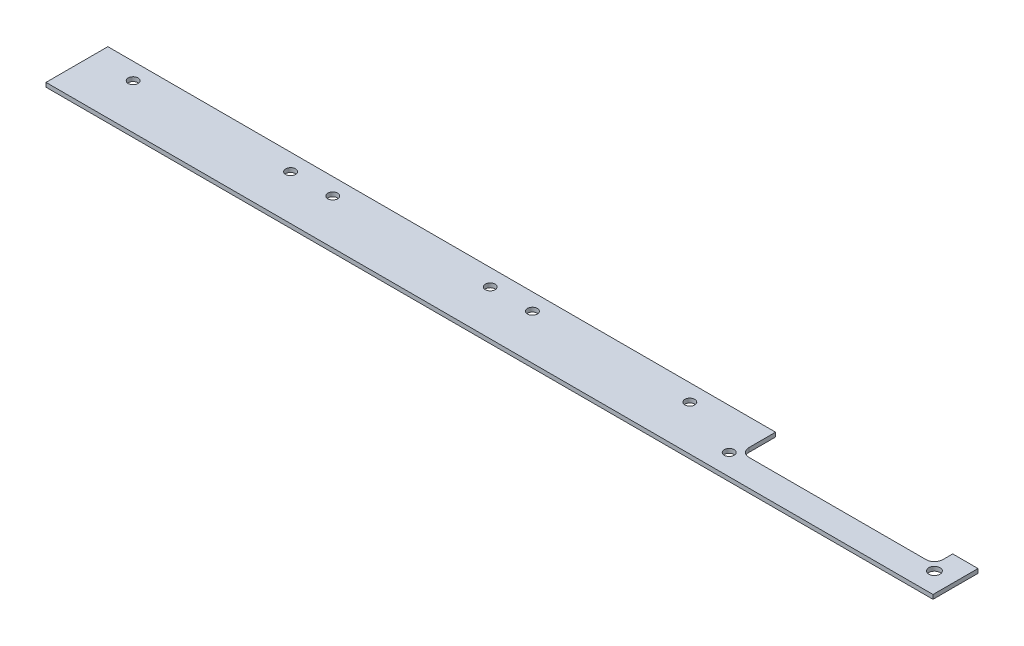
ISO-10303-21;
HEADER;
FILE_DESCRIPTION(('STEP AP214'),'2;1');
FILE_NAME('part.step','',(''),(''),'','','');
FILE_SCHEMA(('AUTOMOTIVE_DESIGN { 1 0 10303 214 1 1 1 1 }'));
ENDSEC;
DATA;
#1=APPLICATION_CONTEXT('core data for automotive mechanical design processes');
#2=APPLICATION_PROTOCOL_DEFINITION('international standard','automotive_design',2000,#1);
#3=PRODUCT_CONTEXT('',#1,'mechanical');
#4=PRODUCT('Part','Part','',(#3));
#5=PRODUCT_RELATED_PRODUCT_CATEGORY('part','',(#4));
#6=PRODUCT_DEFINITION_FORMATION('','',#4);
#7=PRODUCT_DEFINITION_CONTEXT('part definition',#1,'design');
#8=PRODUCT_DEFINITION('design','',#6,#7);
#9=PRODUCT_DEFINITION_SHAPE('','',#8);
#10=(LENGTH_UNIT() NAMED_UNIT(*) SI_UNIT(.MILLI.,.METRE.));
#11=(NAMED_UNIT(*) PLANE_ANGLE_UNIT() SI_UNIT($,.RADIAN.));
#12=(NAMED_UNIT(*) SI_UNIT($,.STERADIAN.) SOLID_ANGLE_UNIT());
#13=UNCERTAINTY_MEASURE_WITH_UNIT(LENGTH_MEASURE(1.E-05),#10,'distance_accuracy_value','');
#14=(GEOMETRIC_REPRESENTATION_CONTEXT(3) GLOBAL_UNCERTAINTY_ASSIGNED_CONTEXT((#13)) GLOBAL_UNIT_ASSIGNED_CONTEXT((#10,
#11,#12)) REPRESENTATION_CONTEXT('',''));
#15=CARTESIAN_POINT('',(0.,0.,0.));
#16=DIRECTION('',(0.,0.,1.));
#17=DIRECTION('',(1.,0.,0.));
#18=AXIS2_PLACEMENT_3D('',#15,#16,#17);
#19=CARTESIAN_POINT('',(240.5,1.5,-12.5));
#20=DIRECTION('',(0.,1.,0.));
#21=DIRECTION('',(0.,0.,1.));
#22=AXIS2_PLACEMENT_3D('',#19,#20,#21);
#23=PLANE('',#22);
#24=CARTESIAN_POINT('',(157.,1.5,-16.));
#25=DIRECTION('',(0.,1.,0.));
#26=DIRECTION('',(0.,0.,1.));
#27=AXIS2_PLACEMENT_3D('',#24,#25,#26);
#28=CIRCLE('',#27,1.74999999999998);
#29=CARTESIAN_POINT('',(157.,1.5,-14.25));
#30=VERTEX_POINT('',#29);
#31=EDGE_CURVE('E244',#30,#30,#28,.T.);
#32=ORIENTED_EDGE('',*,*,#31,.F.);
#33=EDGE_LOOP('',(#32));
#34=FACE_BOUND('',#33,.T.);
#35=CARTESIAN_POINT('',(142.,1.5,-16.));
#36=DIRECTION('',(0.,1.,0.));
#37=DIRECTION('',(0.,0.,1.));
#38=AXIS2_PLACEMENT_3D('',#35,#36,#37);
#39=CIRCLE('',#38,1.74999999999998);
#40=CARTESIAN_POINT('',(142.,1.5,-14.25));
#41=VERTEX_POINT('',#40);
#42=EDGE_CURVE('E232',#41,#41,#39,.T.);
#43=ORIENTED_EDGE('',*,*,#42,.F.);
#44=EDGE_LOOP('',(#43));
#45=FACE_BOUND('',#44,.T.);
#46=CARTESIAN_POINT('',(235.5,1.5,-7.5));
#47=DIRECTION('',(0.,1.,0.));
#48=DIRECTION('',(0.,0.,1.));
#49=AXIS2_PLACEMENT_3D('',#46,#47,#48);
#50=CIRCLE('',#49,1.75000000000001);
#51=CARTESIAN_POINT('',(235.5,1.5,-5.74999999999999));
#52=VERTEX_POINT('',#51);
#53=EDGE_CURVE('E220',#52,#52,#50,.T.);
#54=ORIENTED_EDGE('',*,*,#53,.F.);
#55=EDGE_LOOP('',(#54));
#56=FACE_BOUND('',#55,.T.);
#57=CARTESIAN_POINT('',(15.,1.5,-16.));
#58=DIRECTION('',(0.,1.,0.));
#59=DIRECTION('',(0.,0.,1.));
#60=AXIS2_PLACEMENT_3D('',#57,#58,#59);
#61=CIRCLE('',#60,1.75);
#62=CARTESIAN_POINT('',(15.,1.5,-14.25));
#63=VERTEX_POINT('',#62);
#64=EDGE_CURVE('E148',#63,#63,#61,.T.);
#65=ORIENTED_EDGE('',*,*,#64,.F.);
#66=EDGE_LOOP('',(#65));
#67=FACE_BOUND('',#66,.T.);
#68=DIRECTION('',(0.,0.,1.));
#69=VECTOR('',#68,1.);
#70=CARTESIAN_POINT('',(0.,1.5,0.));
#71=LINE('',#70,#69);
#72=CARTESIAN_POINT('',(0.,1.5,-22.));
#73=VERTEX_POINT('',#72);
#74=CARTESIAN_POINT('',(0.,1.5,0.));
#75=VERTEX_POINT('',#74);
#76=EDGE_CURVE('E163',#73,#75,#71,.T.);
#77=ORIENTED_EDGE('',*,*,#76,.T.);
#78=DIRECTION('',(1.,0.,0.));
#79=VECTOR('',#78,1.);
#80=CARTESIAN_POINT('',(0.,1.5,0.));
#81=LINE('',#80,#79);
#82=CARTESIAN_POINT('',(315.5,1.5,0.));
#83=VERTEX_POINT('',#82);
#84=EDGE_CURVE('E101',#75,#83,#81,.T.);
#85=ORIENTED_EDGE('',*,*,#84,.T.);
#86=DIRECTION('',(0.,0.,-1.));
#87=VECTOR('',#86,1.);
#88=CARTESIAN_POINT('',(315.5,1.5,-16.));
#89=LINE('',#88,#87);
#90=CARTESIAN_POINT('',(315.5,1.5,-16.));
#91=VERTEX_POINT('',#90);
#92=EDGE_CURVE('E184',#83,#91,#89,.T.);
#93=ORIENTED_EDGE('',*,*,#92,.T.);
#94=DIRECTION('',(-1.,0.,0.));
#95=VECTOR('',#94,1.);
#96=CARTESIAN_POINT('',(306.5,1.5,-16.));
#97=LINE('',#96,#95);
#98=CARTESIAN_POINT('',(306.5,1.5,-16.));
#99=VERTEX_POINT('',#98);
#100=EDGE_CURVE('E203',#91,#99,#97,.T.);
#101=ORIENTED_EDGE('',*,*,#100,.T.);
#102=DIRECTION('',(0.,0.,1.));
#103=VECTOR('',#102,1.);
#104=CARTESIAN_POINT('',(306.5,1.5,-12.5));
#105=LINE('',#104,#103);
#106=CARTESIAN_POINT('',(306.5,1.5,-12.5));
#107=VERTEX_POINT('',#106);
#108=EDGE_CURVE('E200',#99,#107,#105,.T.);
#109=ORIENTED_EDGE('',*,*,#108,.T.);
#110=CARTESIAN_POINT('',(303.5,1.5,-12.5));
#111=DIRECTION('',(0.,-1.,0.));
#112=DIRECTION('',(0.,0.,1.));
#113=AXIS2_PLACEMENT_3D('',#110,#111,#112);
#114=CIRCLE('',#113,3.);
#115=CARTESIAN_POINT('',(303.5,1.5,-9.5));
#116=VERTEX_POINT('',#115);
#117=EDGE_CURVE('E202',#107,#116,#114,.T.);
#118=ORIENTED_EDGE('',*,*,#117,.T.);
#119=DIRECTION('',(-1.,0.,0.));
#120=VECTOR('',#119,1.);
#121=CARTESIAN_POINT('',(240.5,1.5,-9.5));
#122=LINE('',#121,#120);
#123=CARTESIAN_POINT('',(240.5,1.5,-9.5));
#124=VERTEX_POINT('',#123);
#125=EDGE_CURVE('E126',#116,#124,#122,.T.);
#126=ORIENTED_EDGE('',*,*,#125,.T.);
#127=CARTESIAN_POINT('',(240.5,1.5,-12.5));
#128=DIRECTION('',(0.,-1.,0.));
#129=DIRECTION('',(0.,0.,1.));
#130=AXIS2_PLACEMENT_3D('',#127,#128,#129);
#131=CIRCLE('',#130,3.);
#132=CARTESIAN_POINT('',(237.5,1.5,-12.5));
#133=VERTEX_POINT('',#132);
#134=EDGE_CURVE('E120',#124,#133,#131,.T.);
#135=ORIENTED_EDGE('',*,*,#134,.T.);
#136=DIRECTION('',(0.,0.,-1.));
#137=VECTOR('',#136,1.);
#138=CARTESIAN_POINT('',(237.5,1.5,-22.));
#139=LINE('',#138,#137);
#140=CARTESIAN_POINT('',(237.5,1.5,-22.));
#141=VERTEX_POINT('',#140);
#142=EDGE_CURVE('E124',#133,#141,#139,.T.);
#143=ORIENTED_EDGE('',*,*,#142,.T.);
#144=DIRECTION('',(-1.,0.,0.));
#145=VECTOR('',#144,1.);
#146=CARTESIAN_POINT('',(0.,1.5,-22.));
#147=LINE('',#146,#145);
#148=EDGE_CURVE('E52',#141,#73,#147,.T.);
#149=ORIENTED_EDGE('',*,*,#148,.T.);
#150=EDGE_LOOP('',(#77,#85,#93,#101,#109,#118,#126,#135,#143,#149));
#151=FACE_BOUND('',#150,.T.);
#152=CARTESIAN_POINT('',(71.,1.5,-16.));
#153=DIRECTION('',(0.,1.,0.));
#154=DIRECTION('',(0.,0.,1.));
#155=AXIS2_PLACEMENT_3D('',#152,#153,#154);
#156=CIRCLE('',#155,1.75);
#157=CARTESIAN_POINT('',(71.,1.5,-14.25));
#158=VERTEX_POINT('',#157);
#159=EDGE_CURVE('E214',#158,#158,#156,.T.);
#160=ORIENTED_EDGE('',*,*,#159,.F.);
#161=EDGE_LOOP('',(#160));
#162=FACE_BOUND('',#161,.T.);
#163=CARTESIAN_POINT('',(85.9999999999999,1.5,-16.));
#164=DIRECTION('',(0.,1.,0.));
#165=DIRECTION('',(0.,0.,1.));
#166=AXIS2_PLACEMENT_3D('',#163,#164,#165);
#167=CIRCLE('',#166,1.75);
#168=CARTESIAN_POINT('',(85.9999999999999,1.5,-14.25));
#169=VERTEX_POINT('',#168);
#170=EDGE_CURVE('E226',#169,#169,#167,.T.);
#171=ORIENTED_EDGE('',*,*,#170,.F.);
#172=EDGE_LOOP('',(#171));
#173=FACE_BOUND('',#172,.T.);
#174=CARTESIAN_POINT('',(308.5,1.5,-7.5));
#175=DIRECTION('',(0.,1.,0.));
#176=DIRECTION('',(0.,0.,1.));
#177=AXIS2_PLACEMENT_3D('',#174,#175,#176);
#178=CIRCLE('',#177,2.);
#179=CARTESIAN_POINT('',(308.5,1.5,-5.5));
#180=VERTEX_POINT('',#179);
#181=EDGE_CURVE('E238',#180,#180,#178,.T.);
#182=ORIENTED_EDGE('',*,*,#181,.F.);
#183=EDGE_LOOP('',(#182));
#184=FACE_BOUND('',#183,.T.);
#185=CARTESIAN_POINT('',(213.,1.5,-16.));
#186=DIRECTION('',(0.,1.,0.));
#187=DIRECTION('',(0.,0.,1.));
#188=AXIS2_PLACEMENT_3D('',#185,#186,#187);
#189=CIRCLE('',#188,1.75000000000001);
#190=CARTESIAN_POINT('',(213.,1.5,-14.25));
#191=VERTEX_POINT('',#190);
#192=EDGE_CURVE('E250',#191,#191,#189,.T.);
#193=ORIENTED_EDGE('',*,*,#192,.F.);
#194=EDGE_LOOP('',(#193));
#195=FACE_BOUND('',#194,.T.);
#196=ADVANCED_FACE('F35',(#34,#45,#56,#67,#151,#162,#173,#184,#195),#23,.T.);
#197=CARTESIAN_POINT('',(240.5,0.,-12.5));
#198=DIRECTION('',(0.,1.,0.));
#199=DIRECTION('',(0.,0.,1.));
#200=AXIS2_PLACEMENT_3D('',#197,#198,#199);
#201=PLANE('',#200);
#202=DIRECTION('',(0.,0.,1.));
#203=VECTOR('',#202,1.);
#204=CARTESIAN_POINT('',(0.,0.,0.));
#205=LINE('',#204,#203);
#206=CARTESIAN_POINT('',(0.,0.,-22.));
#207=VERTEX_POINT('',#206);
#208=CARTESIAN_POINT('',(0.,0.,0.));
#209=VERTEX_POINT('',#208);
#210=EDGE_CURVE('E144',#207,#209,#205,.T.);
#211=ORIENTED_EDGE('',*,*,#210,.F.);
#212=DIRECTION('',(-1.,0.,0.));
#213=VECTOR('',#212,1.);
#214=CARTESIAN_POINT('',(0.,0.,-22.));
#215=LINE('',#214,#213);
#216=CARTESIAN_POINT('',(237.5,0.,-22.));
#217=VERTEX_POINT('',#216);
#218=EDGE_CURVE('E93',#217,#207,#215,.T.);
#219=ORIENTED_EDGE('',*,*,#218,.F.);
#220=DIRECTION('',(0.,0.,-1.));
#221=VECTOR('',#220,1.);
#222=CARTESIAN_POINT('',(237.5,0.,-22.));
#223=LINE('',#222,#221);
#224=CARTESIAN_POINT('',(237.5,0.,-12.5));
#225=VERTEX_POINT('',#224);
#226=EDGE_CURVE('E87',#225,#217,#223,.T.);
#227=ORIENTED_EDGE('',*,*,#226,.F.);
#228=CARTESIAN_POINT('',(240.5,0.,-12.5));
#229=DIRECTION('',(0.,-1.,0.));
#230=DIRECTION('',(0.,0.,1.));
#231=AXIS2_PLACEMENT_3D('',#228,#229,#230);
#232=CIRCLE('',#231,3.);
#233=CARTESIAN_POINT('',(240.5,0.,-9.5));
#234=VERTEX_POINT('',#233);
#235=EDGE_CURVE('E134',#234,#225,#232,.T.);
#236=ORIENTED_EDGE('',*,*,#235,.F.);
#237=DIRECTION('',(-1.,0.,0.));
#238=VECTOR('',#237,1.);
#239=CARTESIAN_POINT('',(240.5,0.,-9.5));
#240=LINE('',#239,#238);
#241=CARTESIAN_POINT('',(303.5,0.,-9.5));
#242=VERTEX_POINT('',#241);
#243=EDGE_CURVE('E158',#242,#234,#240,.T.);
#244=ORIENTED_EDGE('',*,*,#243,.F.);
#245=CARTESIAN_POINT('',(303.5,0.,-12.5));
#246=DIRECTION('',(0.,-1.,0.));
#247=DIRECTION('',(0.,0.,1.));
#248=AXIS2_PLACEMENT_3D('',#245,#246,#247);
#249=CIRCLE('',#248,3.);
#250=CARTESIAN_POINT('',(306.5,0.,-12.5));
#251=VERTEX_POINT('',#250);
#252=EDGE_CURVE('E156',#251,#242,#249,.T.);
#253=ORIENTED_EDGE('',*,*,#252,.F.);
#254=DIRECTION('',(0.,0.,1.));
#255=VECTOR('',#254,1.);
#256=CARTESIAN_POINT('',(306.5,0.,-12.5));
#257=LINE('',#256,#255);
#258=CARTESIAN_POINT('',(306.5,0.,-16.));
#259=VERTEX_POINT('',#258);
#260=EDGE_CURVE('E154',#259,#251,#257,.T.);
#261=ORIENTED_EDGE('',*,*,#260,.F.);
#262=DIRECTION('',(-1.,0.,0.));
#263=VECTOR('',#262,1.);
#264=CARTESIAN_POINT('',(306.5,0.,-16.));
#265=LINE('',#264,#263);
#266=CARTESIAN_POINT('',(315.5,0.,-16.));
#267=VERTEX_POINT('',#266);
#268=EDGE_CURVE('E152',#267,#259,#265,.T.);
#269=ORIENTED_EDGE('',*,*,#268,.F.);
#270=DIRECTION('',(0.,0.,-1.));
#271=VECTOR('',#270,1.);
#272=CARTESIAN_POINT('',(315.5,0.,-16.));
#273=LINE('',#272,#271);
#274=CARTESIAN_POINT('',(315.5,0.,0.));
#275=VERTEX_POINT('',#274);
#276=EDGE_CURVE('E150',#275,#267,#273,.T.);
#277=ORIENTED_EDGE('',*,*,#276,.F.);
#278=DIRECTION('',(1.,0.,0.));
#279=VECTOR('',#278,1.);
#280=CARTESIAN_POINT('',(0.,0.,0.));
#281=LINE('',#280,#279);
#282=EDGE_CURVE('E147',#209,#275,#281,.T.);
#283=ORIENTED_EDGE('',*,*,#282,.F.);
#284=EDGE_LOOP('',(#211,#219,#227,#236,#244,#253,#261,#269,#277,#283));
#285=FACE_BOUND('',#284,.T.);
#286=CARTESIAN_POINT('',(15.,0.,-16.));
#287=DIRECTION('',(0.,1.,0.));
#288=DIRECTION('',(0.,0.,1.));
#289=AXIS2_PLACEMENT_3D('',#286,#287,#288);
#290=CIRCLE('',#289,1.75);
#291=CARTESIAN_POINT('',(15.,0.,-14.25));
#292=VERTEX_POINT('',#291);
#293=EDGE_CURVE('E211',#292,#292,#290,.T.);
#294=ORIENTED_EDGE('',*,*,#293,.T.);
#295=EDGE_LOOP('',(#294));
#296=FACE_BOUND('',#295,.T.);
#297=CARTESIAN_POINT('',(71.,0.,-16.));
#298=DIRECTION('',(0.,1.,0.));
#299=DIRECTION('',(0.,0.,1.));
#300=AXIS2_PLACEMENT_3D('',#297,#298,#299);
#301=CIRCLE('',#300,1.75);
#302=CARTESIAN_POINT('',(71.,0.,-14.25));
#303=VERTEX_POINT('',#302);
#304=EDGE_CURVE('E217',#303,#303,#301,.T.);
#305=ORIENTED_EDGE('',*,*,#304,.T.);
#306=EDGE_LOOP('',(#305));
#307=FACE_BOUND('',#306,.T.);
#308=CARTESIAN_POINT('',(235.5,0.,-7.5));
#309=DIRECTION('',(0.,1.,0.));
#310=DIRECTION('',(0.,0.,1.));
#311=AXIS2_PLACEMENT_3D('',#308,#309,#310);
#312=CIRCLE('',#311,1.75000000000001);
#313=CARTESIAN_POINT('',(235.5,0.,-5.74999999999999));
#314=VERTEX_POINT('',#313);
#315=EDGE_CURVE('E223',#314,#314,#312,.T.);
#316=ORIENTED_EDGE('',*,*,#315,.T.);
#317=EDGE_LOOP('',(#316));
#318=FACE_BOUND('',#317,.T.);
#319=CARTESIAN_POINT('',(85.9999999999999,0.,-16.));
#320=DIRECTION('',(0.,1.,0.));
#321=DIRECTION('',(0.,0.,1.));
#322=AXIS2_PLACEMENT_3D('',#319,#320,#321);
#323=CIRCLE('',#322,1.75);
#324=CARTESIAN_POINT('',(85.9999999999999,0.,-14.25));
#325=VERTEX_POINT('',#324);
#326=EDGE_CURVE('E229',#325,#325,#323,.T.);
#327=ORIENTED_EDGE('',*,*,#326,.T.);
#328=EDGE_LOOP('',(#327));
#329=FACE_BOUND('',#328,.T.);
#330=CARTESIAN_POINT('',(142.,0.,-16.));
#331=DIRECTION('',(0.,1.,0.));
#332=DIRECTION('',(0.,0.,1.));
#333=AXIS2_PLACEMENT_3D('',#330,#331,#332);
#334=CIRCLE('',#333,1.74999999999998);
#335=CARTESIAN_POINT('',(142.,0.,-14.25));
#336=VERTEX_POINT('',#335);
#337=EDGE_CURVE('E235',#336,#336,#334,.T.);
#338=ORIENTED_EDGE('',*,*,#337,.T.);
#339=EDGE_LOOP('',(#338));
#340=FACE_BOUND('',#339,.T.);
#341=CARTESIAN_POINT('',(308.5,0.,-7.5));
#342=DIRECTION('',(0.,1.,0.));
#343=DIRECTION('',(0.,0.,1.));
#344=AXIS2_PLACEMENT_3D('',#341,#342,#343);
#345=CIRCLE('',#344,2.);
#346=CARTESIAN_POINT('',(308.5,0.,-5.5));
#347=VERTEX_POINT('',#346);
#348=EDGE_CURVE('E241',#347,#347,#345,.T.);
#349=ORIENTED_EDGE('',*,*,#348,.T.);
#350=EDGE_LOOP('',(#349));
#351=FACE_BOUND('',#350,.T.);
#352=CARTESIAN_POINT('',(157.,0.,-16.));
#353=DIRECTION('',(0.,1.,0.));
#354=DIRECTION('',(0.,0.,1.));
#355=AXIS2_PLACEMENT_3D('',#352,#353,#354);
#356=CIRCLE('',#355,1.74999999999998);
#357=CARTESIAN_POINT('',(157.,0.,-14.25));
#358=VERTEX_POINT('',#357);
#359=EDGE_CURVE('E247',#358,#358,#356,.T.);
#360=ORIENTED_EDGE('',*,*,#359,.T.);
#361=EDGE_LOOP('',(#360));
#362=FACE_BOUND('',#361,.T.);
#363=CARTESIAN_POINT('',(213.,0.,-16.));
#364=DIRECTION('',(0.,1.,0.));
#365=DIRECTION('',(0.,0.,1.));
#366=AXIS2_PLACEMENT_3D('',#363,#364,#365);
#367=CIRCLE('',#366,1.75000000000001);
#368=CARTESIAN_POINT('',(213.,0.,-14.25));
#369=VERTEX_POINT('',#368);
#370=EDGE_CURVE('E253',#369,#369,#367,.T.);
#371=ORIENTED_EDGE('',*,*,#370,.T.);
#372=EDGE_LOOP('',(#371));
#373=FACE_BOUND('',#372,.T.);
#374=ADVANCED_FACE('F188',(#285,#296,#307,#318,#329,#340,#351,#362,#373),#201,.F.);
#375=CARTESIAN_POINT('',(0.,1.5,0.));
#376=DIRECTION('',(1.,0.,0.));
#377=DIRECTION('',(0.,0.,-1.));
#378=AXIS2_PLACEMENT_3D('',#375,#376,#377);
#379=PLANE('',#378);
#380=ORIENTED_EDGE('',*,*,#210,.T.);
#381=DIRECTION('',(0.,-1.,0.));
#382=VECTOR('',#381,1.);
#383=CARTESIAN_POINT('',(0.,1.5,0.));
#384=LINE('',#383,#382);
#385=EDGE_CURVE('E11',#75,#209,#384,.T.);
#386=ORIENTED_EDGE('',*,*,#385,.F.);
#387=ORIENTED_EDGE('',*,*,#76,.F.);
#388=DIRECTION('',(0.,-1.,0.));
#389=VECTOR('',#388,1.);
#390=CARTESIAN_POINT('',(0.,1.5,-22.));
#391=LINE('',#390,#389);
#392=EDGE_CURVE('E140',#73,#207,#391,.T.);
#393=ORIENTED_EDGE('',*,*,#392,.T.);
#394=EDGE_LOOP('',(#380,#386,#387,#393));
#395=FACE_BOUND('',#394,.T.);
#396=ADVANCED_FACE('F37',(#395),#379,.F.);
#397=CARTESIAN_POINT('',(0.,1.5,0.));
#398=DIRECTION('',(0.,0.,-1.));
#399=DIRECTION('',(-1.,0.,0.));
#400=AXIS2_PLACEMENT_3D('',#397,#398,#399);
#401=PLANE('',#400);
#402=ORIENTED_EDGE('',*,*,#282,.T.);
#403=DIRECTION('',(0.,-1.,0.));
#404=VECTOR('',#403,1.);
#405=CARTESIAN_POINT('',(315.5,1.5,0.));
#406=LINE('',#405,#404);
#407=EDGE_CURVE('E44',#83,#275,#406,.T.);
#408=ORIENTED_EDGE('',*,*,#407,.F.);
#409=ORIENTED_EDGE('',*,*,#84,.F.);
#410=ORIENTED_EDGE('',*,*,#385,.T.);
#411=EDGE_LOOP('',(#402,#408,#409,#410));
#412=FACE_BOUND('',#411,.T.);
#413=ADVANCED_FACE('F295',(#412),#401,.F.);
#414=CARTESIAN_POINT('',(315.5,1.5,-16.));
#415=DIRECTION('',(-1.,0.,0.));
#416=DIRECTION('',(0.,0.,1.));
#417=AXIS2_PLACEMENT_3D('',#414,#415,#416);
#418=PLANE('',#417);
#419=ORIENTED_EDGE('',*,*,#276,.T.);
#420=DIRECTION('',(0.,-1.,0.));
#421=VECTOR('',#420,1.);
#422=CARTESIAN_POINT('',(315.5,1.5,-16.));
#423=LINE('',#422,#421);
#424=EDGE_CURVE('E176',#91,#267,#423,.T.);
#425=ORIENTED_EDGE('',*,*,#424,.F.);
#426=ORIENTED_EDGE('',*,*,#92,.F.);
#427=ORIENTED_EDGE('',*,*,#407,.T.);
#428=EDGE_LOOP('',(#419,#425,#426,#427));
#429=FACE_BOUND('',#428,.T.);
#430=ADVANCED_FACE('F182',(#429),#418,.F.);
#431=CARTESIAN_POINT('',(306.5,1.5,-16.));
#432=DIRECTION('',(0.,0.,1.));
#433=DIRECTION('',(1.,0.,0.));
#434=AXIS2_PLACEMENT_3D('',#431,#432,#433);
#435=PLANE('',#434);
#436=ORIENTED_EDGE('',*,*,#268,.T.);
#437=DIRECTION('',(0.,-1.,0.));
#438=VECTOR('',#437,1.);
#439=CARTESIAN_POINT('',(306.5,1.5,-16.));
#440=LINE('',#439,#438);
#441=EDGE_CURVE('E173',#99,#259,#440,.T.);
#442=ORIENTED_EDGE('',*,*,#441,.F.);
#443=ORIENTED_EDGE('',*,*,#100,.F.);
#444=ORIENTED_EDGE('',*,*,#424,.T.);
#445=EDGE_LOOP('',(#436,#442,#443,#444));
#446=FACE_BOUND('',#445,.T.);
#447=ADVANCED_FACE('F194',(#446),#435,.F.);
#448=CARTESIAN_POINT('',(306.5,1.5,-12.5));
#449=DIRECTION('',(1.,0.,0.));
#450=DIRECTION('',(0.,0.,-1.));
#451=AXIS2_PLACEMENT_3D('',#448,#449,#450);
#452=PLANE('',#451);
#453=ORIENTED_EDGE('',*,*,#260,.T.);
#454=DIRECTION('',(0.,-1.,0.));
#455=VECTOR('',#454,1.);
#456=CARTESIAN_POINT('',(306.5,1.5,-12.5));
#457=LINE('',#456,#455);
#458=EDGE_CURVE('E170',#107,#251,#457,.T.);
#459=ORIENTED_EDGE('',*,*,#458,.F.);
#460=ORIENTED_EDGE('',*,*,#108,.F.);
#461=ORIENTED_EDGE('',*,*,#441,.T.);
#462=EDGE_LOOP('',(#453,#459,#460,#461));
#463=FACE_BOUND('',#462,.T.);
#464=ADVANCED_FACE('F198',(#463),#452,.F.);
#465=CARTESIAN_POINT('',(303.5,1.5,-12.5));
#466=DIRECTION('',(0.,-1.,0.));
#467=DIRECTION('',(0.,0.,-1.));
#468=AXIS2_PLACEMENT_3D('',#465,#466,#467);
#469=CYLINDRICAL_SURFACE('',#468,3.);
#470=ORIENTED_EDGE('',*,*,#252,.T.);
#471=DIRECTION('',(0.,-1.,0.));
#472=VECTOR('',#471,1.);
#473=CARTESIAN_POINT('',(303.5,1.5,-9.5));
#474=LINE('',#473,#472);
#475=EDGE_CURVE('E167',#116,#242,#474,.T.);
#476=ORIENTED_EDGE('',*,*,#475,.F.);
#477=ORIENTED_EDGE('',*,*,#117,.F.);
#478=ORIENTED_EDGE('',*,*,#458,.T.);
#479=EDGE_LOOP('',(#470,#476,#477,#478));
#480=FACE_BOUND('',#479,.T.);
#481=ADVANCED_FACE('F285',(#480),#469,.F.);
#482=CARTESIAN_POINT('',(240.5,1.5,-9.5));
#483=DIRECTION('',(0.,0.,1.));
#484=DIRECTION('',(1.,0.,0.));
#485=AXIS2_PLACEMENT_3D('',#482,#483,#484);
#486=PLANE('',#485);
#487=ORIENTED_EDGE('',*,*,#243,.T.);
#488=DIRECTION('',(0.,-1.,0.));
#489=VECTOR('',#488,1.);
#490=CARTESIAN_POINT('',(240.5,1.5,-9.5));
#491=LINE('',#490,#489);
#492=EDGE_CURVE('E135',#124,#234,#491,.T.);
#493=ORIENTED_EDGE('',*,*,#492,.F.);
#494=ORIENTED_EDGE('',*,*,#125,.F.);
#495=ORIENTED_EDGE('',*,*,#475,.T.);
#496=EDGE_LOOP('',(#487,#493,#494,#495));
#497=FACE_BOUND('',#496,.T.);
#498=ADVANCED_FACE('F282',(#497),#486,.F.);
#499=CARTESIAN_POINT('',(240.5,1.5,-12.5));
#500=DIRECTION('',(0.,-1.,0.));
#501=DIRECTION('',(0.,0.,-1.));
#502=AXIS2_PLACEMENT_3D('',#499,#500,#501);
#503=CYLINDRICAL_SURFACE('',#502,3.);
#504=ORIENTED_EDGE('',*,*,#235,.T.);
#505=DIRECTION('',(0.,-1.,0.));
#506=VECTOR('',#505,1.);
#507=CARTESIAN_POINT('',(237.5,1.5,-12.5));
#508=LINE('',#507,#506);
#509=EDGE_CURVE('E131',#133,#225,#508,.T.);
#510=ORIENTED_EDGE('',*,*,#509,.F.);
#511=ORIENTED_EDGE('',*,*,#134,.F.);
#512=ORIENTED_EDGE('',*,*,#492,.T.);
#513=EDGE_LOOP('',(#504,#510,#511,#512));
#514=FACE_BOUND('',#513,.T.);
#515=ADVANCED_FACE('F132',(#514),#503,.F.);
#516=CARTESIAN_POINT('',(237.5,1.5,-22.));
#517=DIRECTION('',(-1.,0.,0.));
#518=DIRECTION('',(0.,0.,1.));
#519=AXIS2_PLACEMENT_3D('',#516,#517,#518);
#520=PLANE('',#519);
#521=ORIENTED_EDGE('',*,*,#226,.T.);
#522=DIRECTION('',(0.,-1.,0.));
#523=VECTOR('',#522,1.);
#524=CARTESIAN_POINT('',(237.5,1.5,-22.));
#525=LINE('',#524,#523);
#526=EDGE_CURVE('E136',#141,#217,#525,.T.);
#527=ORIENTED_EDGE('',*,*,#526,.F.);
#528=ORIENTED_EDGE('',*,*,#142,.F.);
#529=ORIENTED_EDGE('',*,*,#509,.T.);
#530=EDGE_LOOP('',(#521,#527,#528,#529));
#531=FACE_BOUND('',#530,.T.);
#532=ADVANCED_FACE('F138',(#531),#520,.F.);
#533=CARTESIAN_POINT('',(0.,1.5,-22.));
#534=DIRECTION('',(0.,0.,1.));
#535=DIRECTION('',(1.,0.,0.));
#536=AXIS2_PLACEMENT_3D('',#533,#534,#535);
#537=PLANE('',#536);
#538=ORIENTED_EDGE('',*,*,#218,.T.);
#539=ORIENTED_EDGE('',*,*,#392,.F.);
#540=ORIENTED_EDGE('',*,*,#148,.F.);
#541=ORIENTED_EDGE('',*,*,#526,.T.);
#542=EDGE_LOOP('',(#538,#539,#540,#541));
#543=FACE_BOUND('',#542,.T.);
#544=ADVANCED_FACE('F275',(#543),#537,.F.);
#545=CARTESIAN_POINT('',(15.,1.5,-16.));
#546=DIRECTION('',(0.,-1.,0.));
#547=DIRECTION('',(0.,0.,-1.));
#548=AXIS2_PLACEMENT_3D('',#545,#546,#547);
#549=CYLINDRICAL_SURFACE('',#548,1.75);
#550=ORIENTED_EDGE('',*,*,#64,.T.);
#551=EDGE_LOOP('',(#550));
#552=FACE_BOUND('',#551,.T.);
#553=ORIENTED_EDGE('',*,*,#293,.F.);
#554=EDGE_LOOP('',(#553));
#555=FACE_BOUND('',#554,.T.);
#556=ADVANCED_FACE('F272',(#552,#555),#549,.F.);
#557=CARTESIAN_POINT('',(71.,1.5,-16.));
#558=DIRECTION('',(0.,-1.,0.));
#559=DIRECTION('',(0.,0.,-1.));
#560=AXIS2_PLACEMENT_3D('',#557,#558,#559);
#561=CYLINDRICAL_SURFACE('',#560,1.75);
#562=ORIENTED_EDGE('',*,*,#159,.T.);
#563=EDGE_LOOP('',(#562));
#564=FACE_BOUND('',#563,.T.);
#565=ORIENTED_EDGE('',*,*,#304,.F.);
#566=EDGE_LOOP('',(#565));
#567=FACE_BOUND('',#566,.T.);
#568=ADVANCED_FACE('F371',(#564,#567),#561,.F.);
#569=CARTESIAN_POINT('',(235.5,1.5,-7.5));
#570=DIRECTION('',(0.,-1.,0.));
#571=DIRECTION('',(0.,0.,-1.));
#572=AXIS2_PLACEMENT_3D('',#569,#570,#571);
#573=CYLINDRICAL_SURFACE('',#572,1.75000000000001);
#574=ORIENTED_EDGE('',*,*,#53,.T.);
#575=EDGE_LOOP('',(#574));
#576=FACE_BOUND('',#575,.T.);
#577=ORIENTED_EDGE('',*,*,#315,.F.);
#578=EDGE_LOOP('',(#577));
#579=FACE_BOUND('',#578,.T.);
#580=ADVANCED_FACE('F379',(#576,#579),#573,.F.);
#581=CARTESIAN_POINT('',(85.9999999999999,1.5,-16.));
#582=DIRECTION('',(0.,-1.,0.));
#583=DIRECTION('',(0.,0.,-1.));
#584=AXIS2_PLACEMENT_3D('',#581,#582,#583);
#585=CYLINDRICAL_SURFACE('',#584,1.75);
#586=ORIENTED_EDGE('',*,*,#170,.T.);
#587=EDGE_LOOP('',(#586));
#588=FACE_BOUND('',#587,.T.);
#589=ORIENTED_EDGE('',*,*,#326,.F.);
#590=EDGE_LOOP('',(#589));
#591=FACE_BOUND('',#590,.T.);
#592=ADVANCED_FACE('F387',(#588,#591),#585,.F.);
#593=CARTESIAN_POINT('',(142.,1.5,-16.));
#594=DIRECTION('',(0.,-1.,0.));
#595=DIRECTION('',(0.,0.,-1.));
#596=AXIS2_PLACEMENT_3D('',#593,#594,#595);
#597=CYLINDRICAL_SURFACE('',#596,1.74999999999998);
#598=ORIENTED_EDGE('',*,*,#42,.T.);
#599=EDGE_LOOP('',(#598));
#600=FACE_BOUND('',#599,.T.);
#601=ORIENTED_EDGE('',*,*,#337,.F.);
#602=EDGE_LOOP('',(#601));
#603=FACE_BOUND('',#602,.T.);
#604=ADVANCED_FACE('F396',(#600,#603),#597,.F.);
#605=CARTESIAN_POINT('',(308.5,1.5,-7.5));
#606=DIRECTION('',(0.,-1.,0.));
#607=DIRECTION('',(0.,0.,-1.));
#608=AXIS2_PLACEMENT_3D('',#605,#606,#607);
#609=CYLINDRICAL_SURFACE('',#608,2.);
#610=ORIENTED_EDGE('',*,*,#181,.T.);
#611=EDGE_LOOP('',(#610));
#612=FACE_BOUND('',#611,.T.);
#613=ORIENTED_EDGE('',*,*,#348,.F.);
#614=EDGE_LOOP('',(#613));
#615=FACE_BOUND('',#614,.T.);
#616=ADVANCED_FACE('F405',(#612,#615),#609,.F.);
#617=CARTESIAN_POINT('',(157.,1.5,-16.));
#618=DIRECTION('',(0.,-1.,0.));
#619=DIRECTION('',(0.,0.,-1.));
#620=AXIS2_PLACEMENT_3D('',#617,#618,#619);
#621=CYLINDRICAL_SURFACE('',#620,1.74999999999998);
#622=ORIENTED_EDGE('',*,*,#31,.T.);
#623=EDGE_LOOP('',(#622));
#624=FACE_BOUND('',#623,.T.);
#625=ORIENTED_EDGE('',*,*,#359,.F.);
#626=EDGE_LOOP('',(#625));
#627=FACE_BOUND('',#626,.T.);
#628=ADVANCED_FACE('F414',(#624,#627),#621,.F.);
#629=CARTESIAN_POINT('',(213.,1.5,-16.));
#630=DIRECTION('',(0.,-1.,0.));
#631=DIRECTION('',(0.,0.,-1.));
#632=AXIS2_PLACEMENT_3D('',#629,#630,#631);
#633=CYLINDRICAL_SURFACE('',#632,1.75000000000001);
#634=ORIENTED_EDGE('',*,*,#192,.T.);
#635=EDGE_LOOP('',(#634));
#636=FACE_BOUND('',#635,.T.);
#637=ORIENTED_EDGE('',*,*,#370,.F.);
#638=EDGE_LOOP('',(#637));
#639=FACE_BOUND('',#638,.T.);
#640=ADVANCED_FACE('F259',(#636,#639),#633,.F.);
#641=CLOSED_SHELL('',(#196,#374,#396,#413,#430,#447,#464,#481,#498,#515,#532,#544,#556,#568,
#580,#592,#604,#616,#628,#640));
#642=MANIFOLD_SOLID_BREP('B2',#641);
#643=ADVANCED_BREP_SHAPE_REPRESENTATION('',(#18,#642),#14);
#644=SHAPE_DEFINITION_REPRESENTATION(#9,#643);
ENDSEC;
END-ISO-10303-21;
